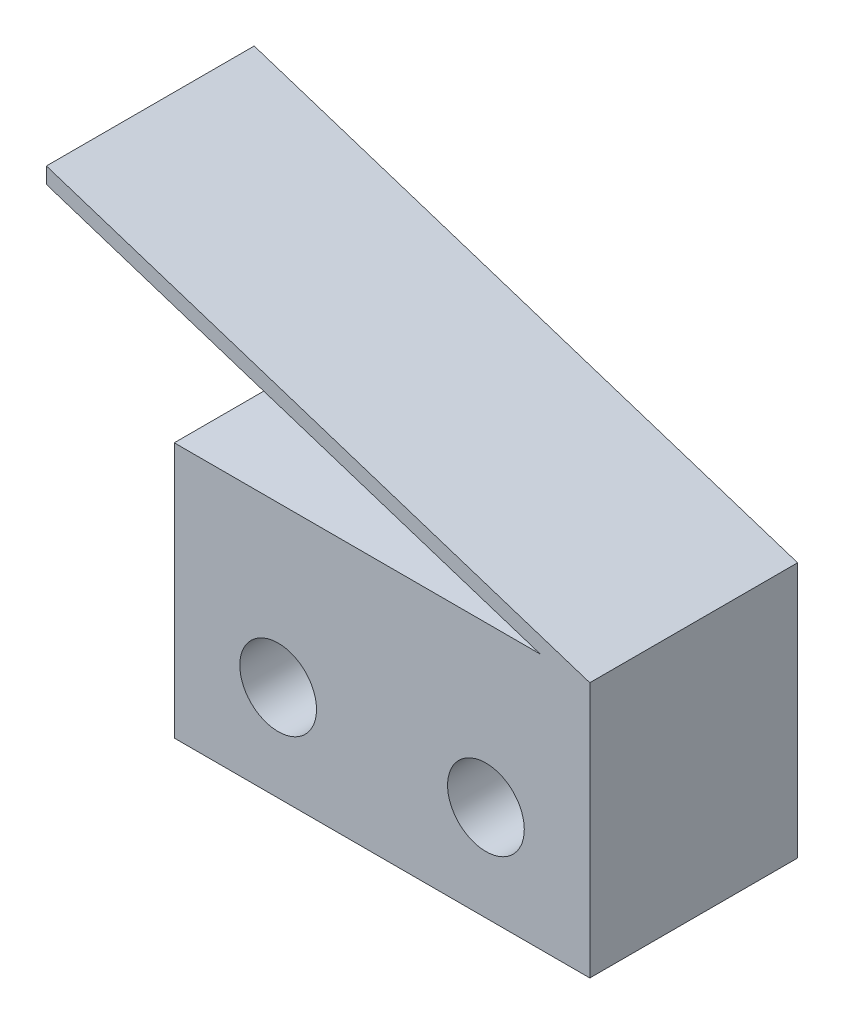
ISO-10303-21;
HEADER;
FILE_DESCRIPTION(('STEP AP214'),'2;1');
FILE_NAME('part.step','',(''),(''),'','','');
FILE_SCHEMA(('AUTOMOTIVE_DESIGN { 1 0 10303 214 1 1 1 1 }'));
ENDSEC;
DATA;
#1=APPLICATION_CONTEXT('core data for automotive mechanical design processes');
#2=APPLICATION_PROTOCOL_DEFINITION('international standard','automotive_design',2000,#1);
#3=PRODUCT_CONTEXT('',#1,'mechanical');
#4=PRODUCT('Part','Part','',(#3));
#5=PRODUCT_RELATED_PRODUCT_CATEGORY('part','',(#4));
#6=PRODUCT_DEFINITION_FORMATION('','',#4);
#7=PRODUCT_DEFINITION_CONTEXT('part definition',#1,'design');
#8=PRODUCT_DEFINITION('design','',#6,#7);
#9=PRODUCT_DEFINITION_SHAPE('','',#8);
#10=(LENGTH_UNIT() NAMED_UNIT(*) SI_UNIT(.MILLI.,.METRE.));
#11=(NAMED_UNIT(*) PLANE_ANGLE_UNIT() SI_UNIT($,.RADIAN.));
#12=(NAMED_UNIT(*) SI_UNIT($,.STERADIAN.) SOLID_ANGLE_UNIT());
#13=UNCERTAINTY_MEASURE_WITH_UNIT(LENGTH_MEASURE(1.E-05),#10,'distance_accuracy_value','');
#14=(GEOMETRIC_REPRESENTATION_CONTEXT(3) GLOBAL_UNCERTAINTY_ASSIGNED_CONTEXT((#13)) GLOBAL_UNIT_ASSIGNED_CONTEXT((#10,
#11,#12)) REPRESENTATION_CONTEXT('',''));
#15=CARTESIAN_POINT('',(0.,0.,0.));
#16=DIRECTION('',(0.,0.,1.));
#17=DIRECTION('',(1.,0.,0.));
#18=AXIS2_PLACEMENT_3D('',#15,#16,#17);
#19=CARTESIAN_POINT('',(0.,8.,6.5));
#20=DIRECTION('',(1.,0.,0.));
#21=DIRECTION('',(0.,1.,0.));
#22=AXIS2_PLACEMENT_3D('',#19,#20,#21);
#23=PLANE('',#22);
#24=DIRECTION('',(0.,-1.,0.));
#25=VECTOR('',#24,1.);
#26=CARTESIAN_POINT('',(0.,8.,0.));
#27=LINE('',#26,#25);
#28=CARTESIAN_POINT('',(0.,8.,0.));
#29=VERTEX_POINT('',#28);
#30=CARTESIAN_POINT('',(0.,0.,0.));
#31=VERTEX_POINT('',#30);
#32=EDGE_CURVE('E123',#29,#31,#27,.T.);
#33=ORIENTED_EDGE('',*,*,#32,.T.);
#34=DIRECTION('',(0.,0.,-1.));
#35=VECTOR('',#34,1.);
#36=CARTESIAN_POINT('',(0.,0.,6.5));
#37=LINE('',#36,#35);
#38=CARTESIAN_POINT('',(0.,0.,6.5));
#39=VERTEX_POINT('',#38);
#40=EDGE_CURVE('E11',#39,#31,#37,.T.);
#41=ORIENTED_EDGE('',*,*,#40,.F.);
#42=DIRECTION('',(0.,-1.,0.));
#43=VECTOR('',#42,1.);
#44=CARTESIAN_POINT('',(0.,8.,6.5));
#45=LINE('',#44,#43);
#46=CARTESIAN_POINT('',(0.,8.,6.5));
#47=VERTEX_POINT('',#46);
#48=EDGE_CURVE('E136',#47,#39,#45,.T.);
#49=ORIENTED_EDGE('',*,*,#48,.F.);
#50=DIRECTION('',(0.,0.,-1.));
#51=VECTOR('',#50,1.);
#52=CARTESIAN_POINT('',(0.,8.,6.5));
#53=LINE('',#52,#51);
#54=EDGE_CURVE('E119',#47,#29,#53,.T.);
#55=ORIENTED_EDGE('',*,*,#54,.T.);
#56=EDGE_LOOP('',(#33,#41,#49,#55));
#57=FACE_BOUND('',#56,.T.);
#58=ADVANCED_FACE('F33',(#57),#23,.F.);
#59=CARTESIAN_POINT('',(0.,0.,6.5));
#60=DIRECTION('',(0.,1.,0.));
#61=DIRECTION('',(0.,0.,1.));
#62=AXIS2_PLACEMENT_3D('',#59,#60,#61);
#63=PLANE('',#62);
#64=DIRECTION('',(1.,0.,0.));
#65=VECTOR('',#64,1.);
#66=CARTESIAN_POINT('',(0.,0.,0.));
#67=LINE('',#66,#65);
#68=CARTESIAN_POINT('',(13.,0.,0.));
#69=VERTEX_POINT('',#68);
#70=EDGE_CURVE('E126',#31,#69,#67,.T.);
#71=ORIENTED_EDGE('',*,*,#70,.T.);
#72=DIRECTION('',(0.,0.,-1.));
#73=VECTOR('',#72,1.);
#74=CARTESIAN_POINT('',(13.,0.,6.5));
#75=LINE('',#74,#73);
#76=CARTESIAN_POINT('',(13.,0.,6.5));
#77=VERTEX_POINT('',#76);
#78=EDGE_CURVE('E41',#77,#69,#75,.T.);
#79=ORIENTED_EDGE('',*,*,#78,.F.);
#80=DIRECTION('',(1.,0.,0.));
#81=VECTOR('',#80,1.);
#82=CARTESIAN_POINT('',(0.,0.,6.5));
#83=LINE('',#82,#81);
#84=EDGE_CURVE('E89',#39,#77,#83,.T.);
#85=ORIENTED_EDGE('',*,*,#84,.F.);
#86=ORIENTED_EDGE('',*,*,#40,.T.);
#87=EDGE_LOOP('',(#71,#79,#85,#86));
#88=FACE_BOUND('',#87,.T.);
#89=ADVANCED_FACE('F195',(#88),#63,.F.);
#90=CARTESIAN_POINT('',(13.,0.,6.5));
#91=DIRECTION('',(-1.,0.,0.));
#92=DIRECTION('',(0.,0.,1.));
#93=AXIS2_PLACEMENT_3D('',#90,#91,#92);
#94=PLANE('',#93);
#95=DIRECTION('',(0.,1.,0.));
#96=VECTOR('',#95,1.);
#97=CARTESIAN_POINT('',(13.,0.,0.));
#98=LINE('',#97,#96);
#99=CARTESIAN_POINT('',(13.,8.,0.));
#100=VERTEX_POINT('',#99);
#101=EDGE_CURVE('E129',#69,#100,#98,.T.);
#102=ORIENTED_EDGE('',*,*,#101,.T.);
#103=DIRECTION('',(0.,0.,-1.));
#104=VECTOR('',#103,1.);
#105=CARTESIAN_POINT('',(13.,8.,6.5));
#106=LINE('',#105,#104);
#107=CARTESIAN_POINT('',(13.,8.,6.5));
#108=VERTEX_POINT('',#107);
#109=EDGE_CURVE('E140',#108,#100,#106,.T.);
#110=ORIENTED_EDGE('',*,*,#109,.F.);
#111=DIRECTION('',(0.,1.,0.));
#112=VECTOR('',#111,1.);
#113=CARTESIAN_POINT('',(13.,0.,6.5));
#114=LINE('',#113,#112);
#115=EDGE_CURVE('E148',#77,#108,#114,.T.);
#116=ORIENTED_EDGE('',*,*,#115,.F.);
#117=ORIENTED_EDGE('',*,*,#78,.T.);
#118=EDGE_LOOP('',(#102,#110,#116,#117));
#119=FACE_BOUND('',#118,.T.);
#120=ADVANCED_FACE('F146',(#119),#94,.F.);
#121=CARTESIAN_POINT('',(13.,8.,6.5));
#122=DIRECTION('',(-0.307820285414662,-0.951444518554411,0.));
#123=DIRECTION('',(0.951444518554412,-0.307820285414663,0.));
#124=AXIS2_PLACEMENT_3D('',#121,#122,#123);
#125=PLANE('',#124);
#126=DIRECTION('',(-0.951444518554411,0.307820285414662,0.));
#127=VECTOR('',#126,1.);
#128=CARTESIAN_POINT('',(13.,8.,0.));
#129=LINE('',#128,#127);
#130=CARTESIAN_POINT('',(-4.,13.5,0.));
#131=VERTEX_POINT('',#130);
#132=EDGE_CURVE('E131',#100,#131,#129,.T.);
#133=ORIENTED_EDGE('',*,*,#132,.T.);
#134=DIRECTION('',(0.,0.,-1.));
#135=VECTOR('',#134,1.);
#136=CARTESIAN_POINT('',(-4.,13.5,6.5));
#137=LINE('',#136,#135);
#138=CARTESIAN_POINT('',(-4.,13.5,6.5));
#139=VERTEX_POINT('',#138);
#140=EDGE_CURVE('E114',#139,#131,#137,.T.);
#141=ORIENTED_EDGE('',*,*,#140,.F.);
#142=DIRECTION('',(-0.951444518554411,0.307820285414662,0.));
#143=VECTOR('',#142,1.);
#144=CARTESIAN_POINT('',(13.,8.,6.5));
#145=LINE('',#144,#143);
#146=EDGE_CURVE('E105',#108,#139,#145,.T.);
#147=ORIENTED_EDGE('',*,*,#146,.F.);
#148=ORIENTED_EDGE('',*,*,#109,.T.);
#149=EDGE_LOOP('',(#133,#141,#147,#148));
#150=FACE_BOUND('',#149,.T.);
#151=ADVANCED_FACE('F154',(#150),#125,.F.);
#152=CARTESIAN_POINT('',(-4.,13.5,6.5));
#153=DIRECTION('',(1.,0.,0.));
#154=DIRECTION('',(0.,1.,0.));
#155=AXIS2_PLACEMENT_3D('',#152,#153,#154);
#156=PLANE('',#155);
#157=DIRECTION('',(0.,-1.,0.));
#158=VECTOR('',#157,1.);
#159=CARTESIAN_POINT('',(-4.,13.5,0.));
#160=LINE('',#159,#158);
#161=CARTESIAN_POINT('',(-4.,13.,0.));
#162=VERTEX_POINT('',#161);
#163=EDGE_CURVE('E113',#131,#162,#160,.T.);
#164=ORIENTED_EDGE('',*,*,#163,.T.);
#165=DIRECTION('',(0.,0.,-1.));
#166=VECTOR('',#165,1.);
#167=CARTESIAN_POINT('',(-4.,13.,6.5));
#168=LINE('',#167,#166);
#169=CARTESIAN_POINT('',(-4.,13.,6.5));
#170=VERTEX_POINT('',#169);
#171=EDGE_CURVE('E110',#170,#162,#168,.T.);
#172=ORIENTED_EDGE('',*,*,#171,.F.);
#173=DIRECTION('',(0.,-1.,0.));
#174=VECTOR('',#173,1.);
#175=CARTESIAN_POINT('',(-4.,13.5,6.5));
#176=LINE('',#175,#174);
#177=EDGE_CURVE('E99',#139,#170,#176,.T.);
#178=ORIENTED_EDGE('',*,*,#177,.F.);
#179=ORIENTED_EDGE('',*,*,#140,.T.);
#180=EDGE_LOOP('',(#164,#172,#178,#179));
#181=FACE_BOUND('',#180,.T.);
#182=ADVANCED_FACE('F111',(#181),#156,.F.);
#183=CARTESIAN_POINT('',(-4.,13.,6.5));
#184=DIRECTION('',(0.307820285414662,0.951444518554411,0.));
#185=DIRECTION('',(-0.951444518554412,0.307820285414662,0.));
#186=AXIS2_PLACEMENT_3D('',#183,#184,#185);
#187=PLANE('',#186);
#188=DIRECTION('',(0.951444518554411,-0.307820285414662,0.));
#189=VECTOR('',#188,1.);
#190=CARTESIAN_POINT('',(-4.,13.,0.));
#191=LINE('',#190,#189);
#192=CARTESIAN_POINT('',(11.4545454545455,8.,0.));
#193=VERTEX_POINT('',#192);
#194=EDGE_CURVE('E75',#162,#193,#191,.T.);
#195=ORIENTED_EDGE('',*,*,#194,.T.);
#196=DIRECTION('',(0.,0.,-1.));
#197=VECTOR('',#196,1.);
#198=CARTESIAN_POINT('',(11.4545454545455,8.,6.5));
#199=LINE('',#198,#197);
#200=CARTESIAN_POINT('',(11.4545454545455,8.,6.5));
#201=VERTEX_POINT('',#200);
#202=EDGE_CURVE('E115',#201,#193,#199,.T.);
#203=ORIENTED_EDGE('',*,*,#202,.F.);
#204=DIRECTION('',(0.951444518554411,-0.307820285414662,0.));
#205=VECTOR('',#204,1.);
#206=CARTESIAN_POINT('',(-4.,13.,6.5));
#207=LINE('',#206,#205);
#208=EDGE_CURVE('E103',#170,#201,#207,.T.);
#209=ORIENTED_EDGE('',*,*,#208,.F.);
#210=ORIENTED_EDGE('',*,*,#171,.T.);
#211=EDGE_LOOP('',(#195,#203,#209,#210));
#212=FACE_BOUND('',#211,.T.);
#213=ADVANCED_FACE('F117',(#212),#187,.F.);
#214=CARTESIAN_POINT('',(11.4545454545455,8.,6.5));
#215=DIRECTION('',(0.,-1.,0.));
#216=DIRECTION('',(1.,0.,0.));
#217=AXIS2_PLACEMENT_3D('',#214,#215,#216);
#218=PLANE('',#217);
#219=DIRECTION('',(-1.,0.,0.));
#220=VECTOR('',#219,1.);
#221=CARTESIAN_POINT('',(11.4545454545455,8.,0.));
#222=LINE('',#221,#220);
#223=EDGE_CURVE('E81',#193,#29,#222,.T.);
#224=ORIENTED_EDGE('',*,*,#223,.T.);
#225=ORIENTED_EDGE('',*,*,#54,.F.);
#226=DIRECTION('',(-1.,0.,0.));
#227=VECTOR('',#226,1.);
#228=CARTESIAN_POINT('',(11.4545454545455,8.,6.5));
#229=LINE('',#228,#227);
#230=EDGE_CURVE('E49',#201,#47,#229,.T.);
#231=ORIENTED_EDGE('',*,*,#230,.F.);
#232=ORIENTED_EDGE('',*,*,#202,.T.);
#233=EDGE_LOOP('',(#224,#225,#231,#232));
#234=FACE_BOUND('',#233,.T.);
#235=ADVANCED_FACE('F182',(#234),#218,.F.);
#236=CARTESIAN_POINT('',(0.,0.,6.5));
#237=DIRECTION('',(0.,0.,1.));
#238=DIRECTION('',(1.,0.,0.));
#239=AXIS2_PLACEMENT_3D('',#236,#237,#238);
#240=PLANE('',#239);
#241=CARTESIAN_POINT('',(3.25,3.,6.5));
#242=DIRECTION('',(0.,0.,1.));
#243=DIRECTION('',(1.,0.,0.));
#244=AXIS2_PLACEMENT_3D('',#241,#242,#243);
#245=CIRCLE('',#244,1.2);
#246=CARTESIAN_POINT('',(4.45,3.,6.5));
#247=VERTEX_POINT('',#246);
#248=EDGE_CURVE('E165',#247,#247,#245,.T.);
#249=ORIENTED_EDGE('',*,*,#248,.F.);
#250=EDGE_LOOP('',(#249));
#251=FACE_BOUND('',#250,.T.);
#252=CARTESIAN_POINT('',(9.75,3.,6.5));
#253=DIRECTION('',(0.,0.,1.));
#254=DIRECTION('',(1.,0.,0.));
#255=AXIS2_PLACEMENT_3D('',#252,#253,#254);
#256=CIRCLE('',#255,1.2);
#257=CARTESIAN_POINT('',(10.95,3.,6.5));
#258=VERTEX_POINT('',#257);
#259=EDGE_CURVE('E159',#258,#258,#256,.T.);
#260=ORIENTED_EDGE('',*,*,#259,.F.);
#261=EDGE_LOOP('',(#260));
#262=FACE_BOUND('',#261,.T.);
#263=ORIENTED_EDGE('',*,*,#48,.T.);
#264=ORIENTED_EDGE('',*,*,#84,.T.);
#265=ORIENTED_EDGE('',*,*,#115,.T.);
#266=ORIENTED_EDGE('',*,*,#146,.T.);
#267=ORIENTED_EDGE('',*,*,#177,.T.);
#268=ORIENTED_EDGE('',*,*,#208,.T.);
#269=ORIENTED_EDGE('',*,*,#230,.T.);
#270=EDGE_LOOP('',(#263,#264,#265,#266,#267,#268,#269));
#271=FACE_BOUND('',#270,.T.);
#272=ADVANCED_FACE('F101',(#251,#262,#271),#240,.T.);
#273=CARTESIAN_POINT('',(0.,0.,0.));
#274=DIRECTION('',(0.,0.,1.));
#275=DIRECTION('',(1.,0.,0.));
#276=AXIS2_PLACEMENT_3D('',#273,#274,#275);
#277=PLANE('',#276);
#278=CARTESIAN_POINT('',(3.25,3.,0.));
#279=DIRECTION('',(0.,0.,1.));
#280=DIRECTION('',(1.,0.,0.));
#281=AXIS2_PLACEMENT_3D('',#278,#279,#280);
#282=CIRCLE('',#281,1.2);
#283=CARTESIAN_POINT('',(4.45,3.,0.));
#284=VERTEX_POINT('',#283);
#285=EDGE_CURVE('E127',#284,#284,#282,.T.);
#286=ORIENTED_EDGE('',*,*,#285,.T.);
#287=EDGE_LOOP('',(#286));
#288=FACE_BOUND('',#287,.T.);
#289=CARTESIAN_POINT('',(9.75,3.,0.));
#290=DIRECTION('',(0.,0.,1.));
#291=DIRECTION('',(1.,0.,0.));
#292=AXIS2_PLACEMENT_3D('',#289,#290,#291);
#293=CIRCLE('',#292,1.2);
#294=CARTESIAN_POINT('',(10.95,3.,0.));
#295=VERTEX_POINT('',#294);
#296=EDGE_CURVE('E162',#295,#295,#293,.T.);
#297=ORIENTED_EDGE('',*,*,#296,.T.);
#298=EDGE_LOOP('',(#297));
#299=FACE_BOUND('',#298,.T.);
#300=ORIENTED_EDGE('',*,*,#32,.F.);
#301=ORIENTED_EDGE('',*,*,#223,.F.);
#302=ORIENTED_EDGE('',*,*,#194,.F.);
#303=ORIENTED_EDGE('',*,*,#163,.F.);
#304=ORIENTED_EDGE('',*,*,#132,.F.);
#305=ORIENTED_EDGE('',*,*,#101,.F.);
#306=ORIENTED_EDGE('',*,*,#70,.F.);
#307=EDGE_LOOP('',(#300,#301,#302,#303,#304,#305,#306));
#308=FACE_BOUND('',#307,.T.);
#309=ADVANCED_FACE('F152',(#288,#299,#308),#277,.F.);
#310=CARTESIAN_POINT('',(9.75,3.,0.));
#311=DIRECTION('',(0.,0.,1.));
#312=DIRECTION('',(1.,0.,0.));
#313=AXIS2_PLACEMENT_3D('',#310,#311,#312);
#314=CYLINDRICAL_SURFACE('',#313,1.2);
#315=ORIENTED_EDGE('',*,*,#296,.F.);
#316=EDGE_LOOP('',(#315));
#317=FACE_BOUND('',#316,.T.);
#318=ORIENTED_EDGE('',*,*,#259,.T.);
#319=EDGE_LOOP('',(#318));
#320=FACE_BOUND('',#319,.T.);
#321=ADVANCED_FACE('F176',(#317,#320),#314,.F.);
#322=CARTESIAN_POINT('',(3.25,3.,0.));
#323=DIRECTION('',(0.,0.,1.));
#324=DIRECTION('',(1.,0.,0.));
#325=AXIS2_PLACEMENT_3D('',#322,#323,#324);
#326=CYLINDRICAL_SURFACE('',#325,1.2);
#327=ORIENTED_EDGE('',*,*,#285,.F.);
#328=EDGE_LOOP('',(#327));
#329=FACE_BOUND('',#328,.T.);
#330=ORIENTED_EDGE('',*,*,#248,.T.);
#331=EDGE_LOOP('',(#330));
#332=FACE_BOUND('',#331,.T.);
#333=ADVANCED_FACE('F173',(#329,#332),#326,.F.);
#334=CLOSED_SHELL('',(#58,#89,#120,#151,#182,#213,#235,#272,#309,#321,#333));
#335=MANIFOLD_SOLID_BREP('B2',#334);
#336=ADVANCED_BREP_SHAPE_REPRESENTATION('',(#18,#335),#14);
#337=SHAPE_DEFINITION_REPRESENTATION(#9,#336);
ENDSEC;
END-ISO-10303-21;
